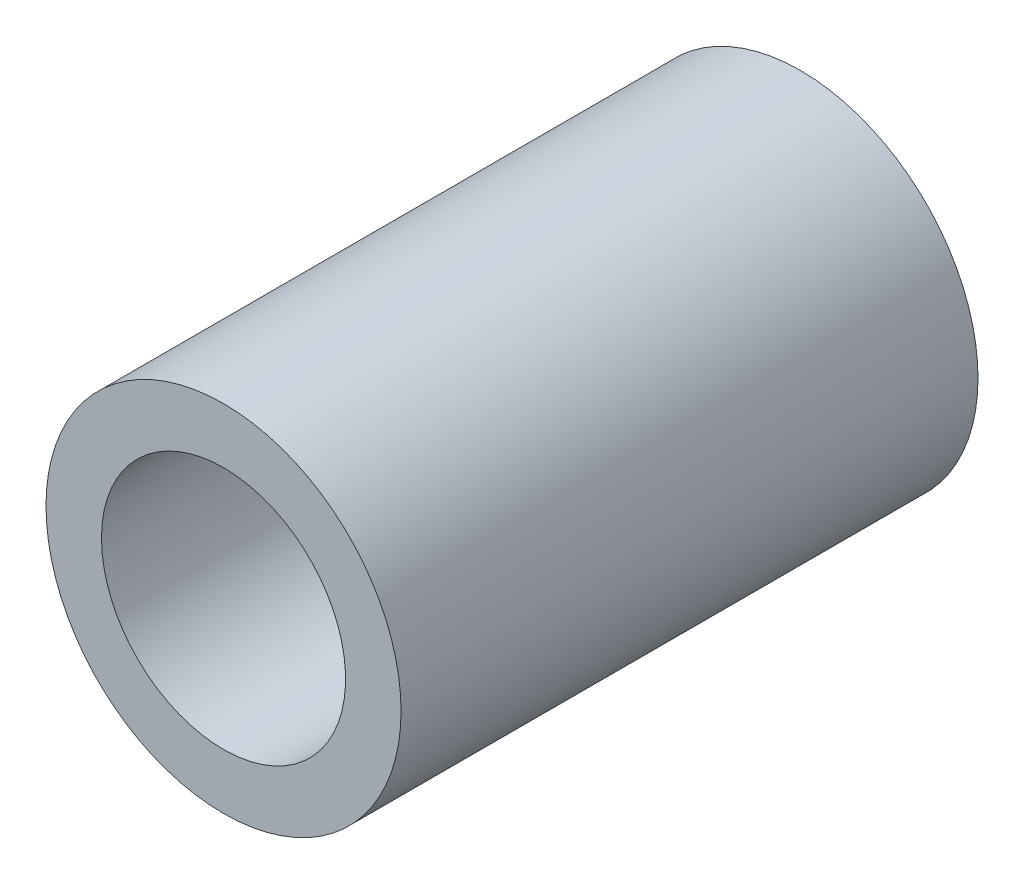
ISO-10303-21;
HEADER;
FILE_DESCRIPTION(('STEP AP214'),'2;1');
FILE_NAME('part.step','',(''),(''),'','','');
FILE_SCHEMA(('AUTOMOTIVE_DESIGN { 1 0 10303 214 1 1 1 1 }'));
ENDSEC;
DATA;
#1=APPLICATION_CONTEXT('core data for automotive mechanical design processes');
#2=APPLICATION_PROTOCOL_DEFINITION('international standard','automotive_design',2000,#1);
#3=PRODUCT_CONTEXT('',#1,'mechanical');
#4=PRODUCT('Part','Part','',(#3));
#5=PRODUCT_RELATED_PRODUCT_CATEGORY('part','',(#4));
#6=PRODUCT_DEFINITION_FORMATION('','',#4);
#7=PRODUCT_DEFINITION_CONTEXT('part definition',#1,'design');
#8=PRODUCT_DEFINITION('design','',#6,#7);
#9=PRODUCT_DEFINITION_SHAPE('','',#8);
#10=(LENGTH_UNIT() NAMED_UNIT(*) SI_UNIT(.MILLI.,.METRE.));
#11=(NAMED_UNIT(*) PLANE_ANGLE_UNIT() SI_UNIT($,.RADIAN.));
#12=(NAMED_UNIT(*) SI_UNIT($,.STERADIAN.) SOLID_ANGLE_UNIT());
#13=UNCERTAINTY_MEASURE_WITH_UNIT(LENGTH_MEASURE(1.E-05),#10,'distance_accuracy_value','');
#14=(GEOMETRIC_REPRESENTATION_CONTEXT(3) GLOBAL_UNCERTAINTY_ASSIGNED_CONTEXT((#13)) GLOBAL_UNIT_ASSIGNED_CONTEXT((#10,
#11,#12)) REPRESENTATION_CONTEXT('',''));
#15=CARTESIAN_POINT('',(0.,0.,0.));
#16=DIRECTION('',(0.,0.,1.));
#17=DIRECTION('',(1.,0.,0.));
#18=AXIS2_PLACEMENT_3D('',#15,#16,#17);
#19=CARTESIAN_POINT('',(0.,0.,52.));
#20=DIRECTION('',(0.,0.,-1.));
#21=DIRECTION('',(-1.,0.,0.));
#22=AXIS2_PLACEMENT_3D('',#19,#20,#21);
#23=CYLINDRICAL_SURFACE('',#22,16.);
#24=CARTESIAN_POINT('',(0.,0.,52.));
#25=DIRECTION('',(0.,0.,1.));
#26=DIRECTION('',(1.,0.,0.));
#27=AXIS2_PLACEMENT_3D('',#24,#25,#26);
#28=CIRCLE('',#27,16.);
#29=CARTESIAN_POINT('',(16.,0.,52.));
#30=VERTEX_POINT('',#29);
#31=EDGE_CURVE('E10',#30,#30,#28,.T.);
#32=ORIENTED_EDGE('',*,*,#31,.F.);
#33=EDGE_LOOP('',(#32));
#34=FACE_BOUND('',#33,.T.);
#35=CARTESIAN_POINT('',(0.,0.,0.));
#36=DIRECTION('',(0.,0.,1.));
#37=DIRECTION('',(1.,0.,0.));
#38=AXIS2_PLACEMENT_3D('',#35,#36,#37);
#39=CIRCLE('',#38,16.);
#40=CARTESIAN_POINT('',(16.,0.,0.));
#41=VERTEX_POINT('',#40);
#42=EDGE_CURVE('E34',#41,#41,#39,.T.);
#43=ORIENTED_EDGE('',*,*,#42,.T.);
#44=EDGE_LOOP('',(#43));
#45=FACE_BOUND('',#44,.T.);
#46=ADVANCED_FACE('F31',(#34,#45),#23,.T.);
#47=CARTESIAN_POINT('',(0.,0.,52.));
#48=DIRECTION('',(0.,0.,1.));
#49=DIRECTION('',(1.,0.,0.));
#50=AXIS2_PLACEMENT_3D('',#47,#48,#49);
#51=PLANE('',#50);
#52=CARTESIAN_POINT('',(0.,0.,52.));
#53=DIRECTION('',(0.,0.,-1.));
#54=DIRECTION('',(-1.,0.,0.));
#55=AXIS2_PLACEMENT_3D('',#52,#53,#54);
#56=CIRCLE('',#55,11.);
#57=CARTESIAN_POINT('',(-11.,0.,52.));
#58=VERTEX_POINT('',#57);
#59=EDGE_CURVE('E41',#58,#58,#56,.T.);
#60=ORIENTED_EDGE('',*,*,#59,.T.);
#61=EDGE_LOOP('',(#60));
#62=FACE_BOUND('',#61,.T.);
#63=ORIENTED_EDGE('',*,*,#31,.T.);
#64=EDGE_LOOP('',(#63));
#65=FACE_BOUND('',#64,.T.);
#66=ADVANCED_FACE('F49',(#62,#65),#51,.T.);
#67=CARTESIAN_POINT('',(0.,0.,0.));
#68=DIRECTION('',(0.,0.,1.));
#69=DIRECTION('',(1.,0.,0.));
#70=AXIS2_PLACEMENT_3D('',#67,#68,#69);
#71=PLANE('',#70);
#72=CARTESIAN_POINT('',(0.,0.,0.));
#73=DIRECTION('',(0.,0.,-1.));
#74=DIRECTION('',(-1.,0.,0.));
#75=AXIS2_PLACEMENT_3D('',#72,#73,#74);
#76=CIRCLE('',#75,11.);
#77=CARTESIAN_POINT('',(-11.,0.,0.));
#78=VERTEX_POINT('',#77);
#79=EDGE_CURVE('E43',#78,#78,#76,.T.);
#80=ORIENTED_EDGE('',*,*,#79,.F.);
#81=EDGE_LOOP('',(#80));
#82=FACE_BOUND('',#81,.T.);
#83=ORIENTED_EDGE('',*,*,#42,.F.);
#84=EDGE_LOOP('',(#83));
#85=FACE_BOUND('',#84,.T.);
#86=ADVANCED_FACE('F54',(#82,#85),#71,.F.);
#87=CARTESIAN_POINT('',(0.,0.,52.));
#88=DIRECTION('',(0.,0.,-1.));
#89=DIRECTION('',(-1.,0.,0.));
#90=AXIS2_PLACEMENT_3D('',#87,#88,#89);
#91=CYLINDRICAL_SURFACE('',#90,11.);
#92=ORIENTED_EDGE('',*,*,#59,.F.);
#93=EDGE_LOOP('',(#92));
#94=FACE_BOUND('',#93,.T.);
#95=ORIENTED_EDGE('',*,*,#79,.T.);
#96=EDGE_LOOP('',(#95));
#97=FACE_BOUND('',#96,.T.);
#98=ADVANCED_FACE('F51',(#94,#97),#91,.F.);
#99=CLOSED_SHELL('',(#46,#66,#86,#98));
#100=MANIFOLD_SOLID_BREP('B2',#99);
#101=ADVANCED_BREP_SHAPE_REPRESENTATION('',(#18,#100),#14);
#102=SHAPE_DEFINITION_REPRESENTATION(#9,#101);
ENDSEC;
END-ISO-10303-21;
